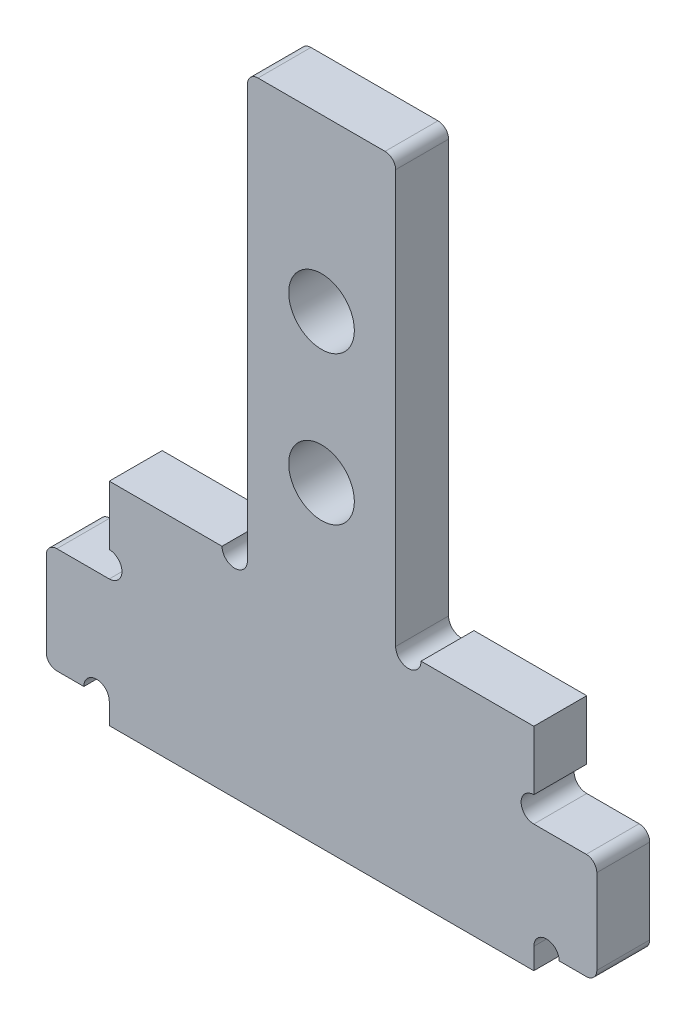
ISO-10303-21;
HEADER;
FILE_DESCRIPTION(('STEP AP214'),'2;1');
FILE_NAME('part.step','',(''),(''),'','','');
FILE_SCHEMA(('AUTOMOTIVE_DESIGN { 1 0 10303 214 1 1 1 1 }'));
ENDSEC;
DATA;
#1=APPLICATION_CONTEXT('core data for automotive mechanical design processes');
#2=APPLICATION_PROTOCOL_DEFINITION('international standard','automotive_design',2000,#1);
#3=PRODUCT_CONTEXT('',#1,'mechanical');
#4=PRODUCT('Part','Part','',(#3));
#5=PRODUCT_RELATED_PRODUCT_CATEGORY('part','',(#4));
#6=PRODUCT_DEFINITION_FORMATION('','',#4);
#7=PRODUCT_DEFINITION_CONTEXT('part definition',#1,'design');
#8=PRODUCT_DEFINITION('design','',#6,#7);
#9=PRODUCT_DEFINITION_SHAPE('','',#8);
#10=(LENGTH_UNIT() NAMED_UNIT(*) SI_UNIT(.MILLI.,.METRE.));
#11=(NAMED_UNIT(*) PLANE_ANGLE_UNIT() SI_UNIT($,.RADIAN.));
#12=(NAMED_UNIT(*) SI_UNIT($,.STERADIAN.) SOLID_ANGLE_UNIT());
#13=UNCERTAINTY_MEASURE_WITH_UNIT(LENGTH_MEASURE(1.E-05),#10,'distance_accuracy_value','');
#14=(GEOMETRIC_REPRESENTATION_CONTEXT(3) GLOBAL_UNCERTAINTY_ASSIGNED_CONTEXT((#13)) GLOBAL_UNIT_ASSIGNED_CONTEXT((#10,
#11,#12)) REPRESENTATION_CONTEXT('',''));
#15=CARTESIAN_POINT('',(0.,0.,0.));
#16=DIRECTION('',(0.,0.,1.));
#17=DIRECTION('',(1.,0.,0.));
#18=AXIS2_PLACEMENT_3D('',#15,#16,#17);
#19=CARTESIAN_POINT('',(-10.025,10.,1.25));
#20=DIRECTION('',(1.,0.,0.));
#21=DIRECTION('',(0.,1.,0.));
#22=AXIS2_PLACEMENT_3D('',#19,#20,#21);
#23=PLANE('',#22);
#24=DIRECTION('',(0.,-1.,0.));
#25=VECTOR('',#24,1.);
#26=CARTESIAN_POINT('',(-10.025,10.,-1.25));
#27=LINE('',#26,#25);
#28=CARTESIAN_POINT('',(-10.025,10.,-1.25));
#29=VERTEX_POINT('',#28);
#30=CARTESIAN_POINT('',(-10.025,7.2,-1.25));
#31=VERTEX_POINT('',#30);
#32=EDGE_CURVE('E244',#29,#31,#27,.T.);
#33=ORIENTED_EDGE('',*,*,#32,.T.);
#34=DIRECTION('',(0.,0.,1.));
#35=VECTOR('',#34,1.);
#36=CARTESIAN_POINT('',(-10.025,7.2,-1.25));
#37=LINE('',#36,#35);
#38=CARTESIAN_POINT('',(-10.025,7.2,1.25));
#39=VERTEX_POINT('',#38);
#40=EDGE_CURVE('E229',#31,#39,#37,.T.);
#41=ORIENTED_EDGE('',*,*,#40,.T.);
#42=DIRECTION('',(0.,-1.,0.));
#43=VECTOR('',#42,1.);
#44=CARTESIAN_POINT('',(-10.025,10.,1.25));
#45=LINE('',#44,#43);
#46=CARTESIAN_POINT('',(-10.025,10.,1.25));
#47=VERTEX_POINT('',#46);
#48=EDGE_CURVE('E365',#47,#39,#45,.T.);
#49=ORIENTED_EDGE('',*,*,#48,.F.);
#50=DIRECTION('',(0.,0.,-1.));
#51=VECTOR('',#50,1.);
#52=CARTESIAN_POINT('',(-10.025,10.,1.25));
#53=LINE('',#52,#51);
#54=EDGE_CURVE('E366',#47,#29,#53,.T.);
#55=ORIENTED_EDGE('',*,*,#54,.T.);
#56=EDGE_LOOP('',(#33,#41,#49,#55));
#57=FACE_BOUND('',#56,.T.);
#58=ADVANCED_FACE('F37',(#57),#23,.F.);
#59=CARTESIAN_POINT('',(-10.025,6.,1.25));
#60=DIRECTION('',(0.,-1.,0.));
#61=DIRECTION('',(1.,0.,0.));
#62=AXIS2_PLACEMENT_3D('',#59,#60,#61);
#63=PLANE('',#62);
#64=DIRECTION('',(-1.,0.,0.));
#65=VECTOR('',#64,1.);
#66=CARTESIAN_POINT('',(-10.025,6.,-1.25));
#67=LINE('',#66,#65);
#68=CARTESIAN_POINT('',(-10.025,6.,-1.25));
#69=VERTEX_POINT('',#68);
#70=CARTESIAN_POINT('',(-12.5,6.,-1.25));
#71=VERTEX_POINT('',#70);
#72=EDGE_CURVE('E236',#69,#71,#67,.T.);
#73=ORIENTED_EDGE('',*,*,#72,.T.);
#74=DIRECTION('',(0.,0.,-1.));
#75=VECTOR('',#74,1.);
#76=CARTESIAN_POINT('',(-12.5,6.,1.25));
#77=LINE('',#76,#75);
#78=CARTESIAN_POINT('',(-12.5,6.,1.25));
#79=VERTEX_POINT('',#78);
#80=EDGE_CURVE('E11',#71,#79,#77,.F.);
#81=ORIENTED_EDGE('',*,*,#80,.T.);
#82=DIRECTION('',(-1.,0.,0.));
#83=VECTOR('',#82,1.);
#84=CARTESIAN_POINT('',(-10.025,6.,1.25));
#85=LINE('',#84,#83);
#86=CARTESIAN_POINT('',(-10.025,6.,1.25));
#87=VERTEX_POINT('',#86);
#88=EDGE_CURVE('E249',#87,#79,#85,.T.);
#89=ORIENTED_EDGE('',*,*,#88,.F.);
#90=DIRECTION('',(0.,0.,-1.));
#91=VECTOR('',#90,1.);
#92=CARTESIAN_POINT('',(-10.025,6.,1.25));
#93=LINE('',#92,#91);
#94=EDGE_CURVE('E226',#87,#69,#93,.T.);
#95=ORIENTED_EDGE('',*,*,#94,.T.);
#96=EDGE_LOOP('',(#73,#81,#89,#95));
#97=FACE_BOUND('',#96,.T.);
#98=ADVANCED_FACE('F247',(#97),#63,.F.);
#99=CARTESIAN_POINT('',(-13.,6.,1.25));
#100=DIRECTION('',(1.,0.,0.));
#101=DIRECTION('',(0.,1.,0.));
#102=AXIS2_PLACEMENT_3D('',#99,#100,#101);
#103=PLANE('',#102);
#104=DIRECTION('',(0.,-1.,0.));
#105=VECTOR('',#104,1.);
#106=CARTESIAN_POINT('',(-13.,6.,-1.25));
#107=LINE('',#106,#105);
#108=CARTESIAN_POINT('',(-13.,5.5,-1.25));
#109=VERTEX_POINT('',#108);
#110=CARTESIAN_POINT('',(-13.,1.5,-1.25));
#111=VERTEX_POINT('',#110);
#112=EDGE_CURVE('E243',#109,#111,#107,.T.);
#113=ORIENTED_EDGE('',*,*,#112,.T.);
#114=DIRECTION('',(0.,0.,-1.));
#115=VECTOR('',#114,1.);
#116=CARTESIAN_POINT('',(-13.,1.5,1.25));
#117=LINE('',#116,#115);
#118=CARTESIAN_POINT('',(-13.,1.5,1.25));
#119=VERTEX_POINT('',#118);
#120=EDGE_CURVE('E45',#111,#119,#117,.F.);
#121=ORIENTED_EDGE('',*,*,#120,.T.);
#122=DIRECTION('',(0.,-1.,0.));
#123=VECTOR('',#122,1.);
#124=CARTESIAN_POINT('',(-13.,6.,1.25));
#125=LINE('',#124,#123);
#126=CARTESIAN_POINT('',(-13.,5.5,1.25));
#127=VERTEX_POINT('',#126);
#128=EDGE_CURVE('E312',#127,#119,#125,.T.);
#129=ORIENTED_EDGE('',*,*,#128,.F.);
#130=DIRECTION('',(0.,0.,-1.));
#131=VECTOR('',#130,1.);
#132=CARTESIAN_POINT('',(-13.,5.5,1.25));
#133=LINE('',#132,#131);
#134=EDGE_CURVE('E304',#127,#109,#133,.T.);
#135=ORIENTED_EDGE('',*,*,#134,.T.);
#136=EDGE_LOOP('',(#113,#121,#129,#135));
#137=FACE_BOUND('',#136,.T.);
#138=ADVANCED_FACE('F311',(#137),#103,.F.);
#139=CARTESIAN_POINT('',(-13.,1.,1.25));
#140=DIRECTION('',(0.,1.,0.));
#141=DIRECTION('',(0.,0.,1.));
#142=AXIS2_PLACEMENT_3D('',#139,#140,#141);
#143=PLANE('',#142);
#144=DIRECTION('',(1.,0.,0.));
#145=VECTOR('',#144,1.);
#146=CARTESIAN_POINT('',(-13.,1.,1.25));
#147=LINE('',#146,#145);
#148=CARTESIAN_POINT('',(-12.5,1.,1.25));
#149=VERTEX_POINT('',#148);
#150=CARTESIAN_POINT('',(-11.225,1.,1.25));
#151=VERTEX_POINT('',#150);
#152=EDGE_CURVE('E320',#149,#151,#147,.T.);
#153=ORIENTED_EDGE('',*,*,#152,.F.);
#154=DIRECTION('',(0.,0.,-1.));
#155=VECTOR('',#154,1.);
#156=CARTESIAN_POINT('',(-12.5,1.,1.25));
#157=LINE('',#156,#155);
#158=CARTESIAN_POINT('',(-12.5,1.,-1.25));
#159=VERTEX_POINT('',#158);
#160=EDGE_CURVE('E301',#149,#159,#157,.T.);
#161=ORIENTED_EDGE('',*,*,#160,.T.);
#162=DIRECTION('',(1.,0.,0.));
#163=VECTOR('',#162,1.);
#164=CARTESIAN_POINT('',(-13.,1.,-1.25));
#165=LINE('',#164,#163);
#166=CARTESIAN_POINT('',(-11.225,1.,-1.25));
#167=VERTEX_POINT('',#166);
#168=EDGE_CURVE('E328',#159,#167,#165,.T.);
#169=ORIENTED_EDGE('',*,*,#168,.T.);
#170=DIRECTION('',(0.,0.,1.));
#171=VECTOR('',#170,1.);
#172=CARTESIAN_POINT('',(-11.225,1.,-1.25));
#173=LINE('',#172,#171);
#174=EDGE_CURVE('E454',#167,#151,#173,.T.);
#175=ORIENTED_EDGE('',*,*,#174,.T.);
#176=EDGE_LOOP('',(#153,#161,#169,#175));
#177=FACE_BOUND('',#176,.T.);
#178=ADVANCED_FACE('F326',(#177),#143,.F.);
#179=CARTESIAN_POINT('',(-10.025,1.,1.25));
#180=DIRECTION('',(1.,0.,0.));
#181=DIRECTION('',(0.,1.,0.));
#182=AXIS2_PLACEMENT_3D('',#179,#180,#181);
#183=PLANE('',#182);
#184=DIRECTION('',(0.,-1.,0.));
#185=VECTOR('',#184,1.);
#186=CARTESIAN_POINT('',(-10.025,1.,-1.25));
#187=LINE('',#186,#185);
#188=CARTESIAN_POINT('',(-10.025,1.,-1.25));
#189=VERTEX_POINT('',#188);
#190=CARTESIAN_POINT('',(-10.025,0.,-1.25));
#191=VERTEX_POINT('',#190);
#192=EDGE_CURVE('E333',#189,#191,#187,.T.);
#193=ORIENTED_EDGE('',*,*,#192,.T.);
#194=DIRECTION('',(0.,0.,-1.));
#195=VECTOR('',#194,1.);
#196=CARTESIAN_POINT('',(-10.025,0.,1.25));
#197=LINE('',#196,#195);
#198=CARTESIAN_POINT('',(-10.025,0.,1.25));
#199=VERTEX_POINT('',#198);
#200=EDGE_CURVE('E253',#199,#191,#197,.T.);
#201=ORIENTED_EDGE('',*,*,#200,.F.);
#202=DIRECTION('',(0.,-1.,0.));
#203=VECTOR('',#202,1.);
#204=CARTESIAN_POINT('',(-10.025,1.,1.25));
#205=LINE('',#204,#203);
#206=CARTESIAN_POINT('',(-10.025,1.,1.25));
#207=VERTEX_POINT('',#206);
#208=EDGE_CURVE('E412',#207,#199,#205,.T.);
#209=ORIENTED_EDGE('',*,*,#208,.F.);
#210=DIRECTION('',(0.,0.,-1.));
#211=VECTOR('',#210,1.);
#212=CARTESIAN_POINT('',(-10.025,1.,1.25));
#213=LINE('',#212,#211);
#214=EDGE_CURVE('E250',#207,#189,#213,.T.);
#215=ORIENTED_EDGE('',*,*,#214,.T.);
#216=EDGE_LOOP('',(#193,#201,#209,#215));
#217=FACE_BOUND('',#216,.T.);
#218=ADVANCED_FACE('F451',(#217),#183,.F.);
#219=CARTESIAN_POINT('',(-10.025,0.,1.25));
#220=DIRECTION('',(0.,1.,0.));
#221=DIRECTION('',(-1.,0.,0.));
#222=AXIS2_PLACEMENT_3D('',#219,#220,#221);
#223=PLANE('',#222);
#224=DIRECTION('',(1.,0.,0.));
#225=VECTOR('',#224,1.);
#226=CARTESIAN_POINT('',(-10.025,0.,-1.25));
#227=LINE('',#226,#225);
#228=CARTESIAN_POINT('',(10.025,0.,-1.25));
#229=VERTEX_POINT('',#228);
#230=EDGE_CURVE('E335',#191,#229,#227,.T.);
#231=ORIENTED_EDGE('',*,*,#230,.T.);
#232=DIRECTION('',(0.,0.,-1.));
#233=VECTOR('',#232,1.);
#234=CARTESIAN_POINT('',(10.025,0.,1.25));
#235=LINE('',#234,#233);
#236=CARTESIAN_POINT('',(10.025,0.,1.25));
#237=VERTEX_POINT('',#236);
#238=EDGE_CURVE('E384',#237,#229,#235,.T.);
#239=ORIENTED_EDGE('',*,*,#238,.F.);
#240=DIRECTION('',(1.,0.,0.));
#241=VECTOR('',#240,1.);
#242=CARTESIAN_POINT('',(-10.025,0.,1.25));
#243=LINE('',#242,#241);
#244=EDGE_CURVE('E393',#199,#237,#243,.T.);
#245=ORIENTED_EDGE('',*,*,#244,.F.);
#246=ORIENTED_EDGE('',*,*,#200,.T.);
#247=EDGE_LOOP('',(#231,#239,#245,#246));
#248=FACE_BOUND('',#247,.T.);
#249=ADVANCED_FACE('F391',(#248),#223,.F.);
#250=CARTESIAN_POINT('',(10.025,0.,1.25));
#251=DIRECTION('',(-1.,0.,0.));
#252=DIRECTION('',(0.,-1.,0.));
#253=AXIS2_PLACEMENT_3D('',#250,#251,#252);
#254=PLANE('',#253);
#255=DIRECTION('',(0.,1.,0.));
#256=VECTOR('',#255,1.);
#257=CARTESIAN_POINT('',(10.025,0.,-1.25));
#258=LINE('',#257,#256);
#259=CARTESIAN_POINT('',(10.025,1.00000000000001,-1.25));
#260=VERTEX_POINT('',#259);
#261=EDGE_CURVE('E340',#229,#260,#258,.T.);
#262=ORIENTED_EDGE('',*,*,#261,.T.);
#263=DIRECTION('',(0.,0.,-1.));
#264=VECTOR('',#263,1.);
#265=CARTESIAN_POINT('',(10.025,1.00000000000001,1.25));
#266=LINE('',#265,#264);
#267=CARTESIAN_POINT('',(10.025,1.00000000000001,1.25));
#268=VERTEX_POINT('',#267);
#269=EDGE_CURVE('E382',#268,#260,#266,.T.);
#270=ORIENTED_EDGE('',*,*,#269,.F.);
#271=DIRECTION('',(0.,1.,0.));
#272=VECTOR('',#271,1.);
#273=CARTESIAN_POINT('',(10.025,0.,1.25));
#274=LINE('',#273,#272);
#275=EDGE_CURVE('E405',#237,#268,#274,.T.);
#276=ORIENTED_EDGE('',*,*,#275,.F.);
#277=ORIENTED_EDGE('',*,*,#238,.T.);
#278=EDGE_LOOP('',(#262,#270,#276,#277));
#279=FACE_BOUND('',#278,.T.);
#280=ADVANCED_FACE('F402',(#279),#254,.F.);
#281=CARTESIAN_POINT('',(10.025,1.00000000000001,1.25));
#282=DIRECTION('',(0.,1.,0.));
#283=DIRECTION('',(-1.,0.,0.));
#284=AXIS2_PLACEMENT_3D('',#281,#282,#283);
#285=PLANE('',#284);
#286=DIRECTION('',(1.,0.,0.));
#287=VECTOR('',#286,1.);
#288=CARTESIAN_POINT('',(10.025,1.00000000000001,-1.25));
#289=LINE('',#288,#287);
#290=CARTESIAN_POINT('',(11.225,1.,-1.25));
#291=VERTEX_POINT('',#290);
#292=CARTESIAN_POINT('',(12.5,1.,-1.25));
#293=VERTEX_POINT('',#292);
#294=EDGE_CURVE('E343',#291,#293,#289,.T.);
#295=ORIENTED_EDGE('',*,*,#294,.T.);
#296=DIRECTION('',(0.,0.,-1.));
#297=VECTOR('',#296,1.);
#298=CARTESIAN_POINT('',(12.5,1.,1.25));
#299=LINE('',#298,#297);
#300=CARTESIAN_POINT('',(12.5,1.,1.25));
#301=VERTEX_POINT('',#300);
#302=EDGE_CURVE('E296',#293,#301,#299,.F.);
#303=ORIENTED_EDGE('',*,*,#302,.T.);
#304=DIRECTION('',(1.,0.,0.));
#305=VECTOR('',#304,1.);
#306=CARTESIAN_POINT('',(10.025,1.00000000000001,1.25));
#307=LINE('',#306,#305);
#308=CARTESIAN_POINT('',(11.225,1.,1.25));
#309=VERTEX_POINT('',#308);
#310=EDGE_CURVE('E407',#309,#301,#307,.T.);
#311=ORIENTED_EDGE('',*,*,#310,.F.);
#312=DIRECTION('',(0.,0.,1.));
#313=VECTOR('',#312,1.);
#314=CARTESIAN_POINT('',(11.225,1.,-1.25));
#315=LINE('',#314,#313);
#316=EDGE_CURVE('E435',#309,#291,#315,.F.);
#317=ORIENTED_EDGE('',*,*,#316,.T.);
#318=EDGE_LOOP('',(#295,#303,#311,#317));
#319=FACE_BOUND('',#318,.T.);
#320=ADVANCED_FACE('F620',(#319),#285,.F.);
#321=CARTESIAN_POINT('',(13.,1.,1.25));
#322=DIRECTION('',(-1.,0.,0.));
#323=DIRECTION('',(0.,-1.,0.));
#324=AXIS2_PLACEMENT_3D('',#321,#322,#323);
#325=PLANE('',#324);
#326=DIRECTION('',(0.,1.,0.));
#327=VECTOR('',#326,1.);
#328=CARTESIAN_POINT('',(13.,1.,1.25));
#329=LINE('',#328,#327);
#330=CARTESIAN_POINT('',(13.,1.5,1.25));
#331=VERTEX_POINT('',#330);
#332=CARTESIAN_POINT('',(13.,5.5,1.25));
#333=VERTEX_POINT('',#332);
#334=EDGE_CURVE('E410',#331,#333,#329,.T.);
#335=ORIENTED_EDGE('',*,*,#334,.F.);
#336=DIRECTION('',(0.,0.,-1.));
#337=VECTOR('',#336,1.);
#338=CARTESIAN_POINT('',(13.,1.5,1.25));
#339=LINE('',#338,#337);
#340=CARTESIAN_POINT('',(13.,1.5,-1.25));
#341=VERTEX_POINT('',#340);
#342=EDGE_CURVE('E293',#331,#341,#339,.T.);
#343=ORIENTED_EDGE('',*,*,#342,.T.);
#344=DIRECTION('',(0.,1.,0.));
#345=VECTOR('',#344,1.);
#346=CARTESIAN_POINT('',(13.,1.,-1.25));
#347=LINE('',#346,#345);
#348=CARTESIAN_POINT('',(13.,5.5,-1.25));
#349=VERTEX_POINT('',#348);
#350=EDGE_CURVE('E346',#341,#349,#347,.T.);
#351=ORIENTED_EDGE('',*,*,#350,.T.);
#352=DIRECTION('',(0.,0.,-1.));
#353=VECTOR('',#352,1.);
#354=CARTESIAN_POINT('',(13.,5.5,1.25));
#355=LINE('',#354,#353);
#356=EDGE_CURVE('E60',#349,#333,#355,.F.);
#357=ORIENTED_EDGE('',*,*,#356,.T.);
#358=EDGE_LOOP('',(#335,#343,#351,#357));
#359=FACE_BOUND('',#358,.T.);
#360=ADVANCED_FACE('F498',(#359),#325,.F.);
#361=CARTESIAN_POINT('',(13.,6.,1.25));
#362=DIRECTION('',(0.,-1.,0.));
#363=DIRECTION('',(1.,0.,0.));
#364=AXIS2_PLACEMENT_3D('',#361,#362,#363);
#365=PLANE('',#364);
#366=DIRECTION('',(-1.,0.,0.));
#367=VECTOR('',#366,1.);
#368=CARTESIAN_POINT('',(13.,6.,1.25));
#369=LINE('',#368,#367);
#370=CARTESIAN_POINT('',(12.5,6.,1.25));
#371=VERTEX_POINT('',#370);
#372=CARTESIAN_POINT('',(10.025,6.,1.25));
#373=VERTEX_POINT('',#372);
#374=EDGE_CURVE('E417',#371,#373,#369,.T.);
#375=ORIENTED_EDGE('',*,*,#374,.F.);
#376=DIRECTION('',(0.,0.,-1.));
#377=VECTOR('',#376,1.);
#378=CARTESIAN_POINT('',(12.5,6.,1.25));
#379=LINE('',#378,#377);
#380=CARTESIAN_POINT('',(12.5,6.,-1.25));
#381=VERTEX_POINT('',#380);
#382=EDGE_CURVE('E298',#371,#381,#379,.T.);
#383=ORIENTED_EDGE('',*,*,#382,.T.);
#384=DIRECTION('',(-1.,0.,0.));
#385=VECTOR('',#384,1.);
#386=CARTESIAN_POINT('',(13.,6.,-1.25));
#387=LINE('',#386,#385);
#388=CARTESIAN_POINT('',(10.025,6.,-1.25));
#389=VERTEX_POINT('',#388);
#390=EDGE_CURVE('E348',#381,#389,#387,.T.);
#391=ORIENTED_EDGE('',*,*,#390,.T.);
#392=DIRECTION('',(0.,0.,-1.));
#393=VECTOR('',#392,1.);
#394=CARTESIAN_POINT('',(10.025,6.,1.25));
#395=LINE('',#394,#393);
#396=EDGE_CURVE('E379',#373,#389,#395,.T.);
#397=ORIENTED_EDGE('',*,*,#396,.F.);
#398=EDGE_LOOP('',(#375,#383,#391,#397));
#399=FACE_BOUND('',#398,.T.);
#400=ADVANCED_FACE('F494',(#399),#365,.F.);
#401=CARTESIAN_POINT('',(10.025,6.,1.25));
#402=DIRECTION('',(-1.,0.,0.));
#403=DIRECTION('',(0.,-1.,0.));
#404=AXIS2_PLACEMENT_3D('',#401,#402,#403);
#405=PLANE('',#404);
#406=DIRECTION('',(0.,1.,0.));
#407=VECTOR('',#406,1.);
#408=CARTESIAN_POINT('',(10.025,6.,1.25));
#409=LINE('',#408,#407);
#410=CARTESIAN_POINT('',(10.025,7.2,1.25));
#411=VERTEX_POINT('',#410);
#412=CARTESIAN_POINT('',(10.025,10.,1.25));
#413=VERTEX_POINT('',#412);
#414=EDGE_CURVE('E419',#411,#413,#409,.T.);
#415=ORIENTED_EDGE('',*,*,#414,.F.);
#416=DIRECTION('',(0.,0.,1.));
#417=VECTOR('',#416,1.);
#418=CARTESIAN_POINT('',(10.025,7.2,-1.25));
#419=LINE('',#418,#417);
#420=CARTESIAN_POINT('',(10.025,7.2,-1.25));
#421=VERTEX_POINT('',#420);
#422=EDGE_CURVE('E441',#411,#421,#419,.F.);
#423=ORIENTED_EDGE('',*,*,#422,.T.);
#424=DIRECTION('',(0.,1.,0.));
#425=VECTOR('',#424,1.);
#426=CARTESIAN_POINT('',(10.025,6.,-1.25));
#427=LINE('',#426,#425);
#428=CARTESIAN_POINT('',(10.025,10.,-1.25));
#429=VERTEX_POINT('',#428);
#430=EDGE_CURVE('E350',#421,#429,#427,.T.);
#431=ORIENTED_EDGE('',*,*,#430,.T.);
#432=DIRECTION('',(0.,0.,-1.));
#433=VECTOR('',#432,1.);
#434=CARTESIAN_POINT('',(10.025,10.,1.25));
#435=LINE('',#434,#433);
#436=EDGE_CURVE('E376',#413,#429,#435,.T.);
#437=ORIENTED_EDGE('',*,*,#436,.F.);
#438=EDGE_LOOP('',(#415,#423,#431,#437));
#439=FACE_BOUND('',#438,.T.);
#440=ADVANCED_FACE('F477',(#439),#405,.F.);
#441=CARTESIAN_POINT('',(10.025,10.,1.25));
#442=DIRECTION('',(0.,-1.,0.));
#443=DIRECTION('',(1.,0.,0.));
#444=AXIS2_PLACEMENT_3D('',#441,#442,#443);
#445=PLANE('',#444);
#446=DIRECTION('',(-1.,0.,0.));
#447=VECTOR('',#446,1.);
#448=CARTESIAN_POINT('',(10.025,10.,-1.25));
#449=LINE('',#448,#447);
#450=CARTESIAN_POINT('',(4.7,10.,-1.25));
#451=VERTEX_POINT('',#450);
#452=EDGE_CURVE('E352',#429,#451,#449,.T.);
#453=ORIENTED_EDGE('',*,*,#452,.T.);
#454=DIRECTION('',(0.,0.,1.));
#455=VECTOR('',#454,1.);
#456=CARTESIAN_POINT('',(4.7,10.,-1.25));
#457=LINE('',#456,#455);
#458=CARTESIAN_POINT('',(4.7,10.,1.25));
#459=VERTEX_POINT('',#458);
#460=EDGE_CURVE('E470',#451,#459,#457,.T.);
#461=ORIENTED_EDGE('',*,*,#460,.T.);
#462=DIRECTION('',(-1.,0.,0.));
#463=VECTOR('',#462,1.);
#464=CARTESIAN_POINT('',(10.025,10.,1.25));
#465=LINE('',#464,#463);
#466=EDGE_CURVE('E421',#413,#459,#465,.T.);
#467=ORIENTED_EDGE('',*,*,#466,.F.);
#468=ORIENTED_EDGE('',*,*,#436,.T.);
#469=EDGE_LOOP('',(#453,#461,#467,#468));
#470=FACE_BOUND('',#469,.T.);
#471=ADVANCED_FACE('F486',(#470),#445,.F.);
#472=CARTESIAN_POINT('',(3.5,10.,1.25));
#473=DIRECTION('',(-1.,0.,0.));
#474=DIRECTION('',(0.,-1.,0.));
#475=AXIS2_PLACEMENT_3D('',#472,#473,#474);
#476=PLANE('',#475);
#477=DIRECTION('',(0.,1.,0.));
#478=VECTOR('',#477,1.);
#479=CARTESIAN_POINT('',(3.5,10.,-1.25));
#480=LINE('',#479,#478);
#481=CARTESIAN_POINT('',(3.5,10.,-1.25));
#482=VERTEX_POINT('',#481);
#483=CARTESIAN_POINT('',(3.5,29.5,-1.25));
#484=VERTEX_POINT('',#483);
#485=EDGE_CURVE('E355',#482,#484,#480,.T.);
#486=ORIENTED_EDGE('',*,*,#485,.T.);
#487=DIRECTION('',(0.,0.,-1.));
#488=VECTOR('',#487,1.);
#489=CARTESIAN_POINT('',(3.5,29.5,1.25));
#490=LINE('',#489,#488);
#491=CARTESIAN_POINT('',(3.5,29.5,1.25));
#492=VERTEX_POINT('',#491);
#493=EDGE_CURVE('E276',#484,#492,#490,.F.);
#494=ORIENTED_EDGE('',*,*,#493,.T.);
#495=DIRECTION('',(0.,1.,0.));
#496=VECTOR('',#495,1.);
#497=CARTESIAN_POINT('',(3.5,10.,1.25));
#498=LINE('',#497,#496);
#499=CARTESIAN_POINT('',(3.5,10.,1.25));
#500=VERTEX_POINT('',#499);
#501=EDGE_CURVE('E424',#500,#492,#498,.T.);
#502=ORIENTED_EDGE('',*,*,#501,.F.);
#503=DIRECTION('',(0.,0.,-1.));
#504=VECTOR('',#503,1.);
#505=CARTESIAN_POINT('',(3.5,10.,1.25));
#506=LINE('',#505,#504);
#507=EDGE_CURVE('E373',#500,#482,#506,.T.);
#508=ORIENTED_EDGE('',*,*,#507,.T.);
#509=EDGE_LOOP('',(#486,#494,#502,#508));
#510=FACE_BOUND('',#509,.T.);
#511=ADVANCED_FACE('F607',(#510),#476,.F.);
#512=CARTESIAN_POINT('',(3.5,30.,1.25));
#513=DIRECTION('',(0.,-1.,0.));
#514=DIRECTION('',(0.,0.,-1.));
#515=AXIS2_PLACEMENT_3D('',#512,#513,#514);
#516=PLANE('',#515);
#517=DIRECTION('',(-1.,0.,0.));
#518=VECTOR('',#517,1.);
#519=CARTESIAN_POINT('',(3.5,30.,1.25));
#520=LINE('',#519,#518);
#521=CARTESIAN_POINT('',(3.,30.,1.25));
#522=VERTEX_POINT('',#521);
#523=CARTESIAN_POINT('',(-3.,30.,1.25));
#524=VERTEX_POINT('',#523);
#525=EDGE_CURVE('E426',#522,#524,#520,.T.);
#526=ORIENTED_EDGE('',*,*,#525,.F.);
#527=DIRECTION('',(0.,0.,-1.));
#528=VECTOR('',#527,1.);
#529=CARTESIAN_POINT('',(3.,30.,1.25));
#530=LINE('',#529,#528);
#531=CARTESIAN_POINT('',(3.,30.,-1.25));
#532=VERTEX_POINT('',#531);
#533=EDGE_CURVE('E262',#522,#532,#530,.T.);
#534=ORIENTED_EDGE('',*,*,#533,.T.);
#535=DIRECTION('',(-1.,0.,0.));
#536=VECTOR('',#535,1.);
#537=CARTESIAN_POINT('',(3.5,30.,-1.25));
#538=LINE('',#537,#536);
#539=CARTESIAN_POINT('',(-3.,30.,-1.25));
#540=VERTEX_POINT('',#539);
#541=EDGE_CURVE('E358',#532,#540,#538,.T.);
#542=ORIENTED_EDGE('',*,*,#541,.T.);
#543=DIRECTION('',(0.,0.,-1.));
#544=VECTOR('',#543,1.);
#545=CARTESIAN_POINT('',(-3.,30.,1.25));
#546=LINE('',#545,#544);
#547=EDGE_CURVE('E260',#540,#524,#546,.F.);
#548=ORIENTED_EDGE('',*,*,#547,.T.);
#549=EDGE_LOOP('',(#526,#534,#542,#548));
#550=FACE_BOUND('',#549,.T.);
#551=ADVANCED_FACE('F604',(#550),#516,.F.);
#552=CARTESIAN_POINT('',(-3.5,30.,1.25));
#553=DIRECTION('',(1.,0.,0.));
#554=DIRECTION('',(0.,1.,0.));
#555=AXIS2_PLACEMENT_3D('',#552,#553,#554);
#556=PLANE('',#555);
#557=DIRECTION('',(0.,-1.,0.));
#558=VECTOR('',#557,1.);
#559=CARTESIAN_POINT('',(-3.5,30.,1.25));
#560=LINE('',#559,#558);
#561=CARTESIAN_POINT('',(-3.5,29.5,1.25));
#562=VERTEX_POINT('',#561);
#563=CARTESIAN_POINT('',(-3.5,10.,1.25));
#564=VERTEX_POINT('',#563);
#565=EDGE_CURVE('E429',#562,#564,#560,.T.);
#566=ORIENTED_EDGE('',*,*,#565,.F.);
#567=DIRECTION('',(0.,0.,-1.));
#568=VECTOR('',#567,1.);
#569=CARTESIAN_POINT('',(-3.5,29.5,1.25));
#570=LINE('',#569,#568);
#571=CARTESIAN_POINT('',(-3.5,29.5,-1.25));
#572=VERTEX_POINT('',#571);
#573=EDGE_CURVE('E289',#562,#572,#570,.T.);
#574=ORIENTED_EDGE('',*,*,#573,.T.);
#575=DIRECTION('',(0.,-1.,0.));
#576=VECTOR('',#575,1.);
#577=CARTESIAN_POINT('',(-3.5,30.,-1.25));
#578=LINE('',#577,#576);
#579=CARTESIAN_POINT('',(-3.5,10.,-1.25));
#580=VERTEX_POINT('',#579);
#581=EDGE_CURVE('E361',#572,#580,#578,.T.);
#582=ORIENTED_EDGE('',*,*,#581,.T.);
#583=DIRECTION('',(0.,0.,-1.));
#584=VECTOR('',#583,1.);
#585=CARTESIAN_POINT('',(-3.5,10.,1.25));
#586=LINE('',#585,#584);
#587=EDGE_CURVE('E369',#564,#580,#586,.T.);
#588=ORIENTED_EDGE('',*,*,#587,.F.);
#589=EDGE_LOOP('',(#566,#574,#582,#588));
#590=FACE_BOUND('',#589,.T.);
#591=ADVANCED_FACE('F537',(#590),#556,.F.);
#592=CARTESIAN_POINT('',(-3.5,10.,1.25));
#593=DIRECTION('',(0.,-1.,0.));
#594=DIRECTION('',(1.,0.,0.));
#595=AXIS2_PLACEMENT_3D('',#592,#593,#594);
#596=PLANE('',#595);
#597=DIRECTION('',(-1.,0.,0.));
#598=VECTOR('',#597,1.);
#599=CARTESIAN_POINT('',(-3.5,10.,1.25));
#600=LINE('',#599,#598);
#601=CARTESIAN_POINT('',(-4.7,10.,1.25));
#602=VERTEX_POINT('',#601);
#603=EDGE_CURVE('E370',#602,#47,#600,.T.);
#604=ORIENTED_EDGE('',*,*,#603,.F.);
#605=DIRECTION('',(0.,0.,1.));
#606=VECTOR('',#605,1.);
#607=CARTESIAN_POINT('',(-4.7,10.,-1.25));
#608=LINE('',#607,#606);
#609=CARTESIAN_POINT('',(-4.7,10.,-1.25));
#610=VERTEX_POINT('',#609);
#611=EDGE_CURVE('E432',#602,#610,#608,.F.);
#612=ORIENTED_EDGE('',*,*,#611,.T.);
#613=DIRECTION('',(-1.,0.,0.));
#614=VECTOR('',#613,1.);
#615=CARTESIAN_POINT('',(-3.5,10.,-1.25));
#616=LINE('',#615,#614);
#617=EDGE_CURVE('E363',#610,#29,#616,.T.);
#618=ORIENTED_EDGE('',*,*,#617,.T.);
#619=ORIENTED_EDGE('',*,*,#54,.F.);
#620=EDGE_LOOP('',(#604,#612,#618,#619));
#621=FACE_BOUND('',#620,.T.);
#622=ADVANCED_FACE('F542',(#621),#596,.F.);
#623=CARTESIAN_POINT('',(0.,0.,1.25));
#624=DIRECTION('',(0.,0.,-1.));
#625=DIRECTION('',(-1.,0.,0.));
#626=AXIS2_PLACEMENT_3D('',#623,#624,#625);
#627=PLANE('',#626);
#628=CARTESIAN_POINT('',(0.,14.95,1.25));
#629=DIRECTION('',(0.,0.,1.));
#630=DIRECTION('',(1.,0.,0.));
#631=AXIS2_PLACEMENT_3D('',#628,#629,#630);
#632=CIRCLE('',#631,1.55);
#633=CARTESIAN_POINT('',(1.55,14.95,1.25));
#634=VERTEX_POINT('',#633);
#635=EDGE_CURVE('E549',#634,#634,#632,.T.);
#636=ORIENTED_EDGE('',*,*,#635,.F.);
#637=EDGE_LOOP('',(#636));
#638=FACE_BOUND('',#637,.T.);
#639=CARTESIAN_POINT('',(0.,21.95,1.25));
#640=DIRECTION('',(0.,0.,1.));
#641=DIRECTION('',(1.,0.,0.));
#642=AXIS2_PLACEMENT_3D('',#639,#640,#641);
#643=CIRCLE('',#642,1.55);
#644=CARTESIAN_POINT('',(1.55,21.95,1.25));
#645=VERTEX_POINT('',#644);
#646=EDGE_CURVE('E553',#645,#645,#643,.T.);
#647=ORIENTED_EDGE('',*,*,#646,.F.);
#648=EDGE_LOOP('',(#647));
#649=FACE_BOUND('',#648,.T.);
#650=ORIENTED_EDGE('',*,*,#501,.T.);
#651=CARTESIAN_POINT('',(3.,29.5,1.25));
#652=DIRECTION('',(0.,0.,-1.));
#653=DIRECTION('',(-1.,0.,0.));
#654=AXIS2_PLACEMENT_3D('',#651,#652,#653);
#655=CIRCLE('',#654,0.5);
#656=EDGE_CURVE('E287',#492,#522,#655,.F.);
#657=ORIENTED_EDGE('',*,*,#656,.T.);
#658=ORIENTED_EDGE('',*,*,#525,.T.);
#659=CARTESIAN_POINT('',(-3.,29.5,1.25));
#660=DIRECTION('',(0.,0.,-1.));
#661=DIRECTION('',(-1.,0.,0.));
#662=AXIS2_PLACEMENT_3D('',#659,#660,#661);
#663=CIRCLE('',#662,0.5);
#664=EDGE_CURVE('E285',#524,#562,#663,.F.);
#665=ORIENTED_EDGE('',*,*,#664,.T.);
#666=ORIENTED_EDGE('',*,*,#565,.T.);
#667=CARTESIAN_POINT('',(-4.1,10.,1.25));
#668=DIRECTION('',(0.,0.,1.));
#669=DIRECTION('',(1.,0.,0.));
#670=AXIS2_PLACEMENT_3D('',#667,#668,#669);
#671=CIRCLE('',#670,0.6);
#672=EDGE_CURVE('E461',#602,#564,#671,.T.);
#673=ORIENTED_EDGE('',*,*,#672,.F.);
#674=ORIENTED_EDGE('',*,*,#603,.T.);
#675=ORIENTED_EDGE('',*,*,#48,.T.);
#676=CARTESIAN_POINT('',(-10.025,6.6,1.25));
#677=DIRECTION('',(0.,0.,1.));
#678=DIRECTION('',(1.,0.,0.));
#679=AXIS2_PLACEMENT_3D('',#676,#677,#678);
#680=CIRCLE('',#679,0.6);
#681=EDGE_CURVE('E455',#87,#39,#680,.T.);
#682=ORIENTED_EDGE('',*,*,#681,.F.);
#683=ORIENTED_EDGE('',*,*,#88,.T.);
#684=CARTESIAN_POINT('',(-12.5,5.5,1.25));
#685=DIRECTION('',(0.,0.,-1.));
#686=DIRECTION('',(-1.,0.,0.));
#687=AXIS2_PLACEMENT_3D('',#684,#685,#686);
#688=CIRCLE('',#687,0.5);
#689=EDGE_CURVE('E278',#79,#127,#688,.F.);
#690=ORIENTED_EDGE('',*,*,#689,.T.);
#691=ORIENTED_EDGE('',*,*,#128,.T.);
#692=CARTESIAN_POINT('',(-12.5,1.5,1.25));
#693=DIRECTION('',(0.,0.,-1.));
#694=DIRECTION('',(-1.,0.,0.));
#695=AXIS2_PLACEMENT_3D('',#692,#693,#694);
#696=CIRCLE('',#695,0.5);
#697=EDGE_CURVE('E280',#119,#149,#696,.F.);
#698=ORIENTED_EDGE('',*,*,#697,.T.);
#699=ORIENTED_EDGE('',*,*,#152,.T.);
#700=CARTESIAN_POINT('',(-10.625,1.,1.25));
#701=DIRECTION('',(0.,0.,1.));
#702=DIRECTION('',(1.,0.,0.));
#703=AXIS2_PLACEMENT_3D('',#700,#701,#702);
#704=CIRCLE('',#703,0.6);
#705=EDGE_CURVE('E450',#207,#151,#704,.T.);
#706=ORIENTED_EDGE('',*,*,#705,.F.);
#707=ORIENTED_EDGE('',*,*,#208,.T.);
#708=ORIENTED_EDGE('',*,*,#244,.T.);
#709=ORIENTED_EDGE('',*,*,#275,.T.);
#710=CARTESIAN_POINT('',(10.625,1.00000000000001,1.25));
#711=DIRECTION('',(0.,0.,1.));
#712=DIRECTION('',(1.,0.,0.));
#713=AXIS2_PLACEMENT_3D('',#710,#711,#712);
#714=CIRCLE('',#713,0.6);
#715=EDGE_CURVE('E544',#309,#268,#714,.T.);
#716=ORIENTED_EDGE('',*,*,#715,.F.);
#717=ORIENTED_EDGE('',*,*,#310,.T.);
#718=CARTESIAN_POINT('',(12.5,1.5,1.25));
#719=DIRECTION('',(0.,0.,-1.));
#720=DIRECTION('',(-1.,0.,0.));
#721=AXIS2_PLACEMENT_3D('',#718,#719,#720);
#722=CIRCLE('',#721,0.5);
#723=EDGE_CURVE('E283',#301,#331,#722,.F.);
#724=ORIENTED_EDGE('',*,*,#723,.T.);
#725=ORIENTED_EDGE('',*,*,#334,.T.);
#726=CARTESIAN_POINT('',(12.5,5.5,1.25));
#727=DIRECTION('',(0.,0.,-1.));
#728=DIRECTION('',(-1.,0.,0.));
#729=AXIS2_PLACEMENT_3D('',#726,#727,#728);
#730=CIRCLE('',#729,0.5);
#731=EDGE_CURVE('E52',#333,#371,#730,.F.);
#732=ORIENTED_EDGE('',*,*,#731,.T.);
#733=ORIENTED_EDGE('',*,*,#374,.T.);
#734=CARTESIAN_POINT('',(10.025,6.6,1.25));
#735=DIRECTION('',(0.,0.,1.));
#736=DIRECTION('',(1.,0.,0.));
#737=AXIS2_PLACEMENT_3D('',#734,#735,#736);
#738=CIRCLE('',#737,0.6);
#739=EDGE_CURVE('E466',#411,#373,#738,.T.);
#740=ORIENTED_EDGE('',*,*,#739,.F.);
#741=ORIENTED_EDGE('',*,*,#414,.T.);
#742=ORIENTED_EDGE('',*,*,#466,.T.);
#743=CARTESIAN_POINT('',(4.1,10.,1.25));
#744=DIRECTION('',(0.,0.,1.));
#745=DIRECTION('',(1.,0.,0.));
#746=AXIS2_PLACEMENT_3D('',#743,#744,#745);
#747=CIRCLE('',#746,0.6);
#748=EDGE_CURVE('E489',#500,#459,#747,.T.);
#749=ORIENTED_EDGE('',*,*,#748,.F.);
#750=EDGE_LOOP('',(#650,#657,#658,#665,#666,#673,#674,#675,#682,#683,#690,#691,#698,#699,#706,
#707,#708,#709,#716,#717,#724,#725,#732,#733,#740,#741,#742,#749));
#751=FACE_BOUND('',#750,.T.);
#752=ADVANCED_FACE('F317',(#638,#649,#751),#627,.F.);
#753=CARTESIAN_POINT('',(0.,0.,-1.25));
#754=DIRECTION('',(0.,0.,-1.));
#755=DIRECTION('',(-1.,0.,0.));
#756=AXIS2_PLACEMENT_3D('',#753,#754,#755);
#757=PLANE('',#756);
#758=CARTESIAN_POINT('',(0.,14.95,-1.25));
#759=DIRECTION('',(0.,0.,1.));
#760=DIRECTION('',(1.,0.,0.));
#761=AXIS2_PLACEMENT_3D('',#758,#759,#760);
#762=CIRCLE('',#761,1.55);
#763=CARTESIAN_POINT('',(1.55,14.95,-1.25));
#764=VERTEX_POINT('',#763);
#765=EDGE_CURVE('E545',#764,#764,#762,.T.);
#766=ORIENTED_EDGE('',*,*,#765,.T.);
#767=EDGE_LOOP('',(#766));
#768=FACE_BOUND('',#767,.T.);
#769=CARTESIAN_POINT('',(0.,21.95,-1.25));
#770=DIRECTION('',(0.,0.,1.));
#771=DIRECTION('',(1.,0.,0.));
#772=AXIS2_PLACEMENT_3D('',#769,#770,#771);
#773=CIRCLE('',#772,1.55);
#774=CARTESIAN_POINT('',(1.55,21.95,-1.25));
#775=VERTEX_POINT('',#774);
#776=EDGE_CURVE('E556',#775,#775,#773,.T.);
#777=ORIENTED_EDGE('',*,*,#776,.T.);
#778=EDGE_LOOP('',(#777));
#779=FACE_BOUND('',#778,.T.);
#780=ORIENTED_EDGE('',*,*,#541,.F.);
#781=CARTESIAN_POINT('',(3.,29.5,-1.25));
#782=DIRECTION('',(0.,0.,-1.));
#783=DIRECTION('',(-1.,0.,0.));
#784=AXIS2_PLACEMENT_3D('',#781,#782,#783);
#785=CIRCLE('',#784,0.5);
#786=EDGE_CURVE('E274',#532,#484,#785,.T.);
#787=ORIENTED_EDGE('',*,*,#786,.T.);
#788=ORIENTED_EDGE('',*,*,#485,.F.);
#789=CARTESIAN_POINT('',(4.1,10.,-1.25));
#790=DIRECTION('',(0.,0.,-1.));
#791=DIRECTION('',(-1.,0.,0.));
#792=AXIS2_PLACEMENT_3D('',#789,#790,#791);
#793=CIRCLE('',#792,0.6);
#794=EDGE_CURVE('E233',#451,#482,#793,.T.);
#795=ORIENTED_EDGE('',*,*,#794,.F.);
#796=ORIENTED_EDGE('',*,*,#452,.F.);
#797=ORIENTED_EDGE('',*,*,#430,.F.);
#798=CARTESIAN_POINT('',(10.025,6.6,-1.25));
#799=DIRECTION('',(0.,0.,1.));
#800=DIRECTION('',(1.,0.,0.));
#801=AXIS2_PLACEMENT_3D('',#798,#799,#800);
#802=CIRCLE('',#801,0.6);
#803=EDGE_CURVE('E458',#421,#389,#802,.T.);
#804=ORIENTED_EDGE('',*,*,#803,.T.);
#805=ORIENTED_EDGE('',*,*,#390,.F.);
#806=CARTESIAN_POINT('',(12.5,5.5,-1.25));
#807=DIRECTION('',(0.,0.,-1.));
#808=DIRECTION('',(-1.,0.,0.));
#809=AXIS2_PLACEMENT_3D('',#806,#807,#808);
#810=CIRCLE('',#809,0.5);
#811=EDGE_CURVE('E268',#381,#349,#810,.T.);
#812=ORIENTED_EDGE('',*,*,#811,.T.);
#813=ORIENTED_EDGE('',*,*,#350,.F.);
#814=CARTESIAN_POINT('',(12.5,1.5,-1.25));
#815=DIRECTION('',(0.,0.,-1.));
#816=DIRECTION('',(-1.,0.,0.));
#817=AXIS2_PLACEMENT_3D('',#814,#815,#816);
#818=CIRCLE('',#817,0.5);
#819=EDGE_CURVE('E270',#341,#293,#818,.T.);
#820=ORIENTED_EDGE('',*,*,#819,.T.);
#821=ORIENTED_EDGE('',*,*,#294,.F.);
#822=CARTESIAN_POINT('',(10.625,1.00000000000001,-1.25));
#823=DIRECTION('',(0.,0.,1.));
#824=DIRECTION('',(1.,0.,0.));
#825=AXIS2_PLACEMENT_3D('',#822,#823,#824);
#826=CIRCLE('',#825,0.6);
#827=EDGE_CURVE('E399',#291,#260,#826,.T.);
#828=ORIENTED_EDGE('',*,*,#827,.T.);
#829=ORIENTED_EDGE('',*,*,#261,.F.);
#830=ORIENTED_EDGE('',*,*,#230,.F.);
#831=ORIENTED_EDGE('',*,*,#192,.F.);
#832=CARTESIAN_POINT('',(-10.625,1.,-1.25));
#833=DIRECTION('',(0.,0.,1.));
#834=DIRECTION('',(1.,0.,0.));
#835=AXIS2_PLACEMENT_3D('',#832,#833,#834);
#836=CIRCLE('',#835,0.6);
#837=EDGE_CURVE('E332',#189,#167,#836,.T.);
#838=ORIENTED_EDGE('',*,*,#837,.T.);
#839=ORIENTED_EDGE('',*,*,#168,.F.);
#840=CARTESIAN_POINT('',(-12.5,1.5,-1.25));
#841=DIRECTION('',(0.,0.,-1.));
#842=DIRECTION('',(-1.,0.,0.));
#843=AXIS2_PLACEMENT_3D('',#840,#841,#842);
#844=CIRCLE('',#843,0.5);
#845=EDGE_CURVE('E266',#159,#111,#844,.T.);
#846=ORIENTED_EDGE('',*,*,#845,.T.);
#847=ORIENTED_EDGE('',*,*,#112,.F.);
#848=CARTESIAN_POINT('',(-12.5,5.5,-1.25));
#849=DIRECTION('',(0.,0.,-1.));
#850=DIRECTION('',(-1.,0.,0.));
#851=AXIS2_PLACEMENT_3D('',#848,#849,#850);
#852=CIRCLE('',#851,0.5);
#853=EDGE_CURVE('E240',#109,#71,#852,.T.);
#854=ORIENTED_EDGE('',*,*,#853,.T.);
#855=ORIENTED_EDGE('',*,*,#72,.F.);
#856=CARTESIAN_POINT('',(-10.025,6.6,-1.25));
#857=DIRECTION('',(0.,0.,-1.));
#858=DIRECTION('',(-1.,0.,0.));
#859=AXIS2_PLACEMENT_3D('',#856,#857,#858);
#860=CIRCLE('',#859,0.6);
#861=EDGE_CURVE('E222',#31,#69,#860,.T.);
#862=ORIENTED_EDGE('',*,*,#861,.F.);
#863=ORIENTED_EDGE('',*,*,#32,.F.);
#864=ORIENTED_EDGE('',*,*,#617,.F.);
#865=CARTESIAN_POINT('',(-4.1,10.,-1.25));
#866=DIRECTION('',(0.,0.,-1.));
#867=DIRECTION('',(-1.,0.,0.));
#868=AXIS2_PLACEMENT_3D('',#865,#866,#867);
#869=CIRCLE('',#868,0.6);
#870=EDGE_CURVE('E258',#580,#610,#869,.T.);
#871=ORIENTED_EDGE('',*,*,#870,.F.);
#872=ORIENTED_EDGE('',*,*,#581,.F.);
#873=CARTESIAN_POINT('',(-3.,29.5,-1.25));
#874=DIRECTION('',(0.,0.,-1.));
#875=DIRECTION('',(-1.,0.,0.));
#876=AXIS2_PLACEMENT_3D('',#873,#874,#875);
#877=CIRCLE('',#876,0.5);
#878=EDGE_CURVE('E272',#572,#540,#877,.T.);
#879=ORIENTED_EDGE('',*,*,#878,.T.);
#880=EDGE_LOOP('',(#780,#787,#788,#795,#796,#797,#804,#805,#812,#813,#820,#821,#828,#829,#830,
#831,#838,#839,#846,#847,#854,#855,#862,#863,#864,#871,#872,#879));
#881=FACE_BOUND('',#880,.T.);
#882=ADVANCED_FACE('F238',(#768,#779,#881),#757,.T.);
#883=CARTESIAN_POINT('',(-10.025,6.6,-1.25));
#884=DIRECTION('',(0.,0.,1.));
#885=DIRECTION('',(1.,0.,0.));
#886=AXIS2_PLACEMENT_3D('',#883,#884,#885);
#887=CYLINDRICAL_SURFACE('',#886,0.6);
#888=ORIENTED_EDGE('',*,*,#861,.T.);
#889=ORIENTED_EDGE('',*,*,#94,.F.);
#890=ORIENTED_EDGE('',*,*,#681,.T.);
#891=ORIENTED_EDGE('',*,*,#40,.F.);
#892=EDGE_LOOP('',(#888,#889,#890,#891));
#893=FACE_BOUND('',#892,.T.);
#894=ADVANCED_FACE('F224',(#893),#887,.F.);
#895=CARTESIAN_POINT('',(4.1,10.,-1.25));
#896=DIRECTION('',(0.,0.,1.));
#897=DIRECTION('',(1.,0.,0.));
#898=AXIS2_PLACEMENT_3D('',#895,#896,#897);
#899=CYLINDRICAL_SURFACE('',#898,0.6);
#900=ORIENTED_EDGE('',*,*,#794,.T.);
#901=ORIENTED_EDGE('',*,*,#507,.F.);
#902=ORIENTED_EDGE('',*,*,#748,.T.);
#903=ORIENTED_EDGE('',*,*,#460,.F.);
#904=EDGE_LOOP('',(#900,#901,#902,#903));
#905=FACE_BOUND('',#904,.T.);
#906=ADVANCED_FACE('F582',(#905),#899,.F.);
#907=CARTESIAN_POINT('',(-10.625,1.,-1.25));
#908=DIRECTION('',(0.,0.,1.));
#909=DIRECTION('',(1.,0.,0.));
#910=AXIS2_PLACEMENT_3D('',#907,#908,#909);
#911=CYLINDRICAL_SURFACE('',#910,0.6);
#912=ORIENTED_EDGE('',*,*,#837,.F.);
#913=ORIENTED_EDGE('',*,*,#214,.F.);
#914=ORIENTED_EDGE('',*,*,#705,.T.);
#915=ORIENTED_EDGE('',*,*,#174,.F.);
#916=EDGE_LOOP('',(#912,#913,#914,#915));
#917=FACE_BOUND('',#916,.T.);
#918=ADVANCED_FACE('F453',(#917),#911,.F.);
#919=CARTESIAN_POINT('',(10.025,6.6,-1.25));
#920=DIRECTION('',(0.,0.,1.));
#921=DIRECTION('',(1.,0.,0.));
#922=AXIS2_PLACEMENT_3D('',#919,#920,#921);
#923=CYLINDRICAL_SURFACE('',#922,0.6);
#924=ORIENTED_EDGE('',*,*,#803,.F.);
#925=ORIENTED_EDGE('',*,*,#422,.F.);
#926=ORIENTED_EDGE('',*,*,#739,.T.);
#927=ORIENTED_EDGE('',*,*,#396,.T.);
#928=EDGE_LOOP('',(#924,#925,#926,#927));
#929=FACE_BOUND('',#928,.T.);
#930=ADVANCED_FACE('F492',(#929),#923,.F.);
#931=CARTESIAN_POINT('',(10.625,1.00000000000001,-1.25));
#932=DIRECTION('',(0.,0.,1.));
#933=DIRECTION('',(1.,0.,0.));
#934=AXIS2_PLACEMENT_3D('',#931,#932,#933);
#935=CYLINDRICAL_SURFACE('',#934,0.6);
#936=ORIENTED_EDGE('',*,*,#827,.F.);
#937=ORIENTED_EDGE('',*,*,#316,.F.);
#938=ORIENTED_EDGE('',*,*,#715,.T.);
#939=ORIENTED_EDGE('',*,*,#269,.T.);
#940=EDGE_LOOP('',(#936,#937,#938,#939));
#941=FACE_BOUND('',#940,.T.);
#942=ADVANCED_FACE('F585',(#941),#935,.F.);
#943=CARTESIAN_POINT('',(-4.1,10.,-1.25));
#944=DIRECTION('',(0.,0.,1.));
#945=DIRECTION('',(1.,0.,0.));
#946=AXIS2_PLACEMENT_3D('',#943,#944,#945);
#947=CYLINDRICAL_SURFACE('',#946,0.6);
#948=ORIENTED_EDGE('',*,*,#870,.T.);
#949=ORIENTED_EDGE('',*,*,#611,.F.);
#950=ORIENTED_EDGE('',*,*,#672,.T.);
#951=ORIENTED_EDGE('',*,*,#587,.T.);
#952=EDGE_LOOP('',(#948,#949,#950,#951));
#953=FACE_BOUND('',#952,.T.);
#954=ADVANCED_FACE('F522',(#953),#947,.F.);
#955=CARTESIAN_POINT('',(3.,29.5,1.25));
#956=DIRECTION('',(0.,0.,-1.));
#957=DIRECTION('',(-1.,0.,0.));
#958=AXIS2_PLACEMENT_3D('',#955,#956,#957);
#959=CYLINDRICAL_SURFACE('',#958,0.5);
#960=ORIENTED_EDGE('',*,*,#656,.F.);
#961=ORIENTED_EDGE('',*,*,#493,.F.);
#962=ORIENTED_EDGE('',*,*,#786,.F.);
#963=ORIENTED_EDGE('',*,*,#533,.F.);
#964=EDGE_LOOP('',(#960,#961,#962,#963));
#965=FACE_BOUND('',#964,.T.);
#966=ADVANCED_FACE('F519',(#965),#959,.T.);
#967=CARTESIAN_POINT('',(-3.,29.5,1.25));
#968=DIRECTION('',(0.,0.,-1.));
#969=DIRECTION('',(-1.,0.,0.));
#970=AXIS2_PLACEMENT_3D('',#967,#968,#969);
#971=CYLINDRICAL_SURFACE('',#970,0.5);
#972=ORIENTED_EDGE('',*,*,#664,.F.);
#973=ORIENTED_EDGE('',*,*,#547,.F.);
#974=ORIENTED_EDGE('',*,*,#878,.F.);
#975=ORIENTED_EDGE('',*,*,#573,.F.);
#976=EDGE_LOOP('',(#972,#973,#974,#975));
#977=FACE_BOUND('',#976,.T.);
#978=ADVANCED_FACE('F508',(#977),#971,.T.);
#979=CARTESIAN_POINT('',(12.5,1.5,1.25));
#980=DIRECTION('',(0.,0.,-1.));
#981=DIRECTION('',(-1.,0.,0.));
#982=AXIS2_PLACEMENT_3D('',#979,#980,#981);
#983=CYLINDRICAL_SURFACE('',#982,0.5);
#984=ORIENTED_EDGE('',*,*,#723,.F.);
#985=ORIENTED_EDGE('',*,*,#302,.F.);
#986=ORIENTED_EDGE('',*,*,#819,.F.);
#987=ORIENTED_EDGE('',*,*,#342,.F.);
#988=EDGE_LOOP('',(#984,#985,#986,#987));
#989=FACE_BOUND('',#988,.T.);
#990=ADVANCED_FACE('F502',(#989),#983,.T.);
#991=CARTESIAN_POINT('',(12.5,5.5,1.25));
#992=DIRECTION('',(0.,0.,-1.));
#993=DIRECTION('',(-1.,0.,0.));
#994=AXIS2_PLACEMENT_3D('',#991,#992,#993);
#995=CYLINDRICAL_SURFACE('',#994,0.5);
#996=ORIENTED_EDGE('',*,*,#731,.F.);
#997=ORIENTED_EDGE('',*,*,#356,.F.);
#998=ORIENTED_EDGE('',*,*,#811,.F.);
#999=ORIENTED_EDGE('',*,*,#382,.F.);
#1000=EDGE_LOOP('',(#996,#997,#998,#999));
#1001=FACE_BOUND('',#1000,.T.);
#1002=ADVANCED_FACE('F500',(#1001),#995,.T.);
#1003=CARTESIAN_POINT('',(-12.5,1.5,1.25));
#1004=DIRECTION('',(0.,0.,-1.));
#1005=DIRECTION('',(-1.,0.,0.));
#1006=AXIS2_PLACEMENT_3D('',#1003,#1004,#1005);
#1007=CYLINDRICAL_SURFACE('',#1006,0.5);
#1008=ORIENTED_EDGE('',*,*,#697,.F.);
#1009=ORIENTED_EDGE('',*,*,#120,.F.);
#1010=ORIENTED_EDGE('',*,*,#845,.F.);
#1011=ORIENTED_EDGE('',*,*,#160,.F.);
#1012=EDGE_LOOP('',(#1008,#1009,#1010,#1011));
#1013=FACE_BOUND('',#1012,.T.);
#1014=ADVANCED_FACE('F323',(#1013),#1007,.T.);
#1015=CARTESIAN_POINT('',(-12.5,5.5,1.25));
#1016=DIRECTION('',(0.,0.,-1.));
#1017=DIRECTION('',(-1.,0.,0.));
#1018=AXIS2_PLACEMENT_3D('',#1015,#1016,#1017);
#1019=CYLINDRICAL_SURFACE('',#1018,0.5);
#1020=ORIENTED_EDGE('',*,*,#689,.F.);
#1021=ORIENTED_EDGE('',*,*,#80,.F.);
#1022=ORIENTED_EDGE('',*,*,#853,.F.);
#1023=ORIENTED_EDGE('',*,*,#134,.F.);
#1024=EDGE_LOOP('',(#1020,#1021,#1022,#1023));
#1025=FACE_BOUND('',#1024,.T.);
#1026=ADVANCED_FACE('F39',(#1025),#1019,.T.);
#1027=CARTESIAN_POINT('',(0.,21.95,-1.25));
#1028=DIRECTION('',(0.,0.,1.));
#1029=DIRECTION('',(1.,0.,0.));
#1030=AXIS2_PLACEMENT_3D('',#1027,#1028,#1029);
#1031=CYLINDRICAL_SURFACE('',#1030,1.55);
#1032=ORIENTED_EDGE('',*,*,#776,.F.);
#1033=EDGE_LOOP('',(#1032));
#1034=FACE_BOUND('',#1033,.T.);
#1035=ORIENTED_EDGE('',*,*,#646,.T.);
#1036=EDGE_LOOP('',(#1035));
#1037=FACE_BOUND('',#1036,.T.);
#1038=ADVANCED_FACE('F569',(#1034,#1037),#1031,.F.);
#1039=CARTESIAN_POINT('',(0.,14.95,-1.25));
#1040=DIRECTION('',(0.,0.,1.));
#1041=DIRECTION('',(1.,0.,0.));
#1042=AXIS2_PLACEMENT_3D('',#1039,#1040,#1041);
#1043=CYLINDRICAL_SURFACE('',#1042,1.55);
#1044=ORIENTED_EDGE('',*,*,#765,.F.);
#1045=EDGE_LOOP('',(#1044));
#1046=FACE_BOUND('',#1045,.T.);
#1047=ORIENTED_EDGE('',*,*,#635,.T.);
#1048=EDGE_LOOP('',(#1047));
#1049=FACE_BOUND('',#1048,.T.);
#1050=ADVANCED_FACE('F562',(#1046,#1049),#1043,.F.);
#1051=CLOSED_SHELL('',(#58,#98,#138,#178,#218,#249,#280,#320,#360,#400,#440,#471,#511,#551,#591,
#622,#752,#882,#894,#906,#918,#930,#942,#954,#966,#978,#990,#1002,#1014,#1026,#1038,#1050));
#1052=MANIFOLD_SOLID_BREP('B2',#1051);
#1053=ADVANCED_BREP_SHAPE_REPRESENTATION('',(#18,#1052),#14);
#1054=SHAPE_DEFINITION_REPRESENTATION(#9,#1053);
ENDSEC;
END-ISO-10303-21;
